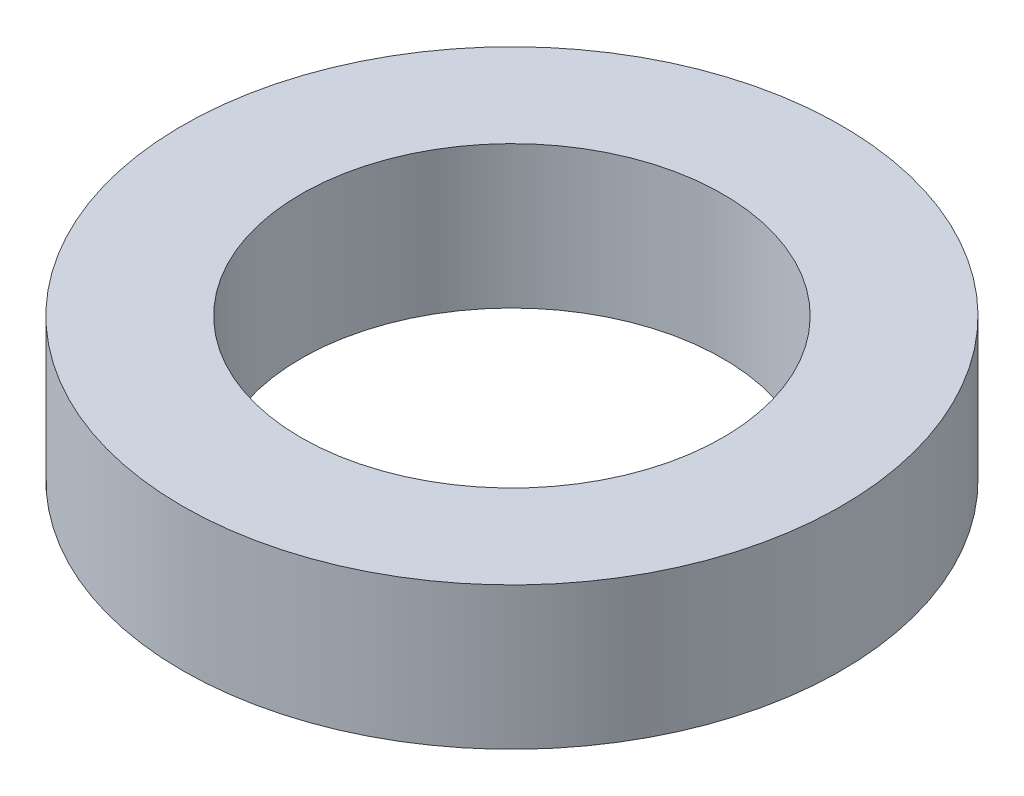
ISO-10303-21;
HEADER;
FILE_DESCRIPTION(('STEP AP214'),'2;1');
FILE_NAME('part.step','',(''),(''),'','','');
FILE_SCHEMA(('AUTOMOTIVE_DESIGN { 1 0 10303 214 1 1 1 1 }'));
ENDSEC;
DATA;
#1=APPLICATION_CONTEXT('core data for automotive mechanical design processes');
#2=APPLICATION_PROTOCOL_DEFINITION('international standard','automotive_design',2000,#1);
#3=PRODUCT_CONTEXT('',#1,'mechanical');
#4=PRODUCT('Part','Part','',(#3));
#5=PRODUCT_RELATED_PRODUCT_CATEGORY('part','',(#4));
#6=PRODUCT_DEFINITION_FORMATION('','',#4);
#7=PRODUCT_DEFINITION_CONTEXT('part definition',#1,'design');
#8=PRODUCT_DEFINITION('design','',#6,#7);
#9=PRODUCT_DEFINITION_SHAPE('','',#8);
#10=(LENGTH_UNIT() NAMED_UNIT(*) SI_UNIT(.MILLI.,.METRE.));
#11=(NAMED_UNIT(*) PLANE_ANGLE_UNIT() SI_UNIT($,.RADIAN.));
#12=(NAMED_UNIT(*) SI_UNIT($,.STERADIAN.) SOLID_ANGLE_UNIT());
#13=UNCERTAINTY_MEASURE_WITH_UNIT(LENGTH_MEASURE(1.E-05),#10,'distance_accuracy_value','');
#14=(GEOMETRIC_REPRESENTATION_CONTEXT(3) GLOBAL_UNCERTAINTY_ASSIGNED_CONTEXT((#13)) GLOBAL_UNIT_ASSIGNED_CONTEXT((#10,
#11,#12)) REPRESENTATION_CONTEXT('',''));
#15=CARTESIAN_POINT('',(0.,0.,0.));
#16=DIRECTION('',(0.,0.,1.));
#17=DIRECTION('',(1.,0.,0.));
#18=AXIS2_PLACEMENT_3D('',#15,#16,#17);
#19=CARTESIAN_POINT('',(0.,27.,0.));
#20=DIRECTION('',(0.,-1.,0.));
#21=DIRECTION('',(0.,0.,-1.));
#22=AXIS2_PLACEMENT_3D('',#19,#20,#21);
#23=CYLINDRICAL_SURFACE('',#22,62.5);
#24=CARTESIAN_POINT('',(0.,27.,0.));
#25=DIRECTION('',(0.,1.,0.));
#26=DIRECTION('',(0.,0.,1.));
#27=AXIS2_PLACEMENT_3D('',#24,#25,#26);
#28=CIRCLE('',#27,62.5);
#29=CARTESIAN_POINT('',(0.,27.,62.5));
#30=VERTEX_POINT('',#29);
#31=EDGE_CURVE('E10',#30,#30,#28,.T.);
#32=ORIENTED_EDGE('',*,*,#31,.F.);
#33=EDGE_LOOP('',(#32));
#34=FACE_BOUND('',#33,.T.);
#35=CARTESIAN_POINT('',(0.,0.,0.));
#36=DIRECTION('',(0.,1.,0.));
#37=DIRECTION('',(0.,0.,1.));
#38=AXIS2_PLACEMENT_3D('',#35,#36,#37);
#39=CIRCLE('',#38,62.5);
#40=CARTESIAN_POINT('',(0.,0.,62.5));
#41=VERTEX_POINT('',#40);
#42=EDGE_CURVE('E37',#41,#41,#39,.T.);
#43=ORIENTED_EDGE('',*,*,#42,.T.);
#44=EDGE_LOOP('',(#43));
#45=FACE_BOUND('',#44,.T.);
#46=ADVANCED_FACE('F40',(#34,#45),#23,.T.);
#47=CARTESIAN_POINT('',(0.,27.,0.));
#48=DIRECTION('',(0.,1.,0.));
#49=DIRECTION('',(0.,0.,1.));
#50=AXIS2_PLACEMENT_3D('',#47,#48,#49);
#51=PLANE('',#50);
#52=CARTESIAN_POINT('',(0.,27.,0.));
#53=DIRECTION('',(0.,1.,0.));
#54=DIRECTION('',(0.,0.,1.));
#55=AXIS2_PLACEMENT_3D('',#52,#53,#54);
#56=CIRCLE('',#55,40.);
#57=CARTESIAN_POINT('',(0.,27.,40.));
#58=VERTEX_POINT('',#57);
#59=EDGE_CURVE('E50',#58,#58,#56,.T.);
#60=ORIENTED_EDGE('',*,*,#59,.F.);
#61=EDGE_LOOP('',(#60));
#62=FACE_BOUND('',#61,.T.);
#63=ORIENTED_EDGE('',*,*,#31,.T.);
#64=EDGE_LOOP('',(#63));
#65=FACE_BOUND('',#64,.T.);
#66=ADVANCED_FACE('F59',(#62,#65),#51,.T.);
#67=CARTESIAN_POINT('',(0.,0.,0.));
#68=DIRECTION('',(0.,1.,0.));
#69=DIRECTION('',(0.,0.,1.));
#70=AXIS2_PLACEMENT_3D('',#67,#68,#69);
#71=PLANE('',#70);
#72=CARTESIAN_POINT('',(0.,0.,0.));
#73=DIRECTION('',(0.,1.,0.));
#74=DIRECTION('',(0.,0.,1.));
#75=AXIS2_PLACEMENT_3D('',#72,#73,#74);
#76=CIRCLE('',#75,40.);
#77=CARTESIAN_POINT('',(0.,0.,40.));
#78=VERTEX_POINT('',#77);
#79=EDGE_CURVE('E47',#78,#78,#76,.T.);
#80=ORIENTED_EDGE('',*,*,#79,.T.);
#81=EDGE_LOOP('',(#80));
#82=FACE_BOUND('',#81,.T.);
#83=ORIENTED_EDGE('',*,*,#42,.F.);
#84=EDGE_LOOP('',(#83));
#85=FACE_BOUND('',#84,.T.);
#86=ADVANCED_FACE('F58',(#82,#85),#71,.F.);
#87=CARTESIAN_POINT('',(0.,27.,0.));
#88=DIRECTION('',(0.,-1.,0.));
#89=DIRECTION('',(0.,0.,-1.));
#90=AXIS2_PLACEMENT_3D('',#87,#88,#89);
#91=CYLINDRICAL_SURFACE('',#90,40.);
#92=ORIENTED_EDGE('',*,*,#59,.T.);
#93=EDGE_LOOP('',(#92));
#94=FACE_BOUND('',#93,.T.);
#95=ORIENTED_EDGE('',*,*,#79,.F.);
#96=EDGE_LOOP('',(#95));
#97=FACE_BOUND('',#96,.T.);
#98=ADVANCED_FACE('F54',(#94,#97),#91,.F.);
#99=CLOSED_SHELL('',(#46,#66,#86,#98));
#100=MANIFOLD_SOLID_BREP('B2',#99);
#101=ADVANCED_BREP_SHAPE_REPRESENTATION('',(#18,#100),#14);
#102=SHAPE_DEFINITION_REPRESENTATION(#9,#101);
ENDSEC;
END-ISO-10303-21;
